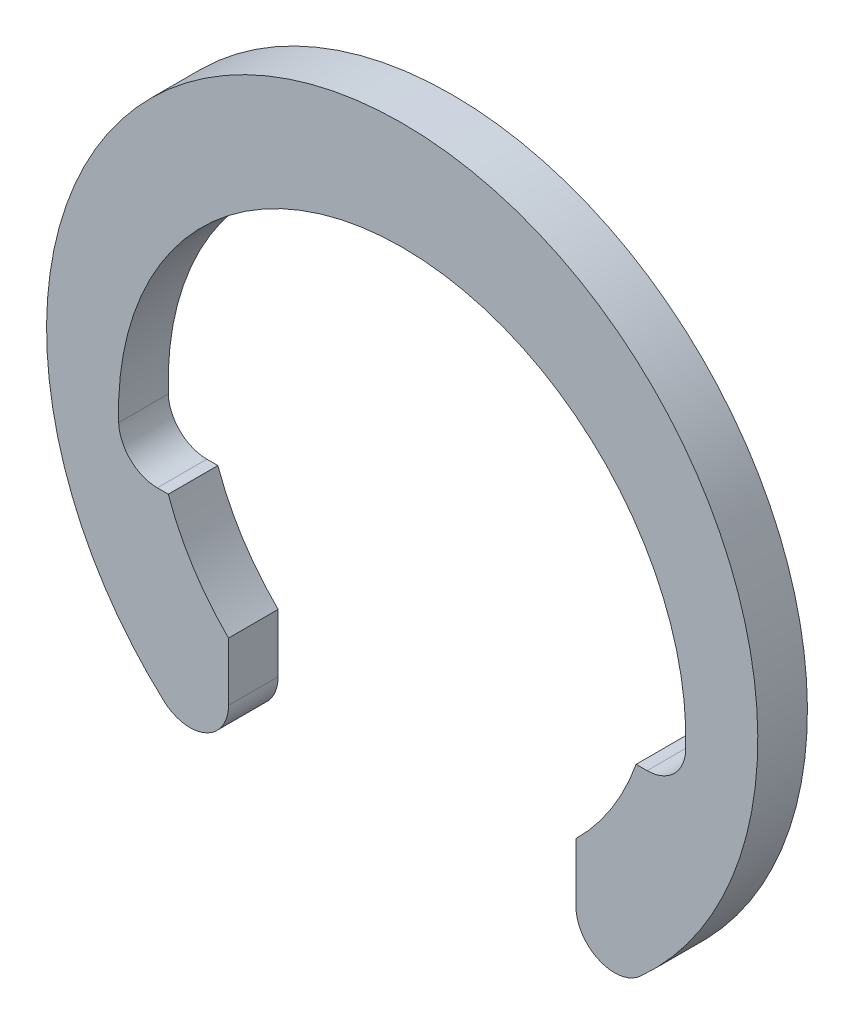
ISO-10303-21;
HEADER;
FILE_DESCRIPTION(('STEP AP214'),'2;1');
FILE_NAME('part.step','',(''),(''),'','','');
FILE_SCHEMA(('AUTOMOTIVE_DESIGN { 1 0 10303 214 1 1 1 1 }'));
ENDSEC;
DATA;
#1=APPLICATION_CONTEXT('core data for automotive mechanical design processes');
#2=APPLICATION_PROTOCOL_DEFINITION('international standard','automotive_design',2000,#1);
#3=PRODUCT_CONTEXT('',#1,'mechanical');
#4=PRODUCT('Part','Part','',(#3));
#5=PRODUCT_RELATED_PRODUCT_CATEGORY('part','',(#4));
#6=PRODUCT_DEFINITION_FORMATION('','',#4);
#7=PRODUCT_DEFINITION_CONTEXT('part definition',#1,'design');
#8=PRODUCT_DEFINITION('design','',#6,#7);
#9=PRODUCT_DEFINITION_SHAPE('','',#8);
#10=(LENGTH_UNIT() NAMED_UNIT(*) SI_UNIT(.MILLI.,.METRE.));
#11=(NAMED_UNIT(*) PLANE_ANGLE_UNIT() SI_UNIT($,.RADIAN.));
#12=(NAMED_UNIT(*) SI_UNIT($,.STERADIAN.) SOLID_ANGLE_UNIT());
#13=UNCERTAINTY_MEASURE_WITH_UNIT(LENGTH_MEASURE(1.E-05),#10,'distance_accuracy_value','');
#14=(GEOMETRIC_REPRESENTATION_CONTEXT(3) GLOBAL_UNCERTAINTY_ASSIGNED_CONTEXT((#13)) GLOBAL_UNIT_ASSIGNED_CONTEXT((#10,
#11,#12)) REPRESENTATION_CONTEXT('',''));
#15=CARTESIAN_POINT('',(0.,0.,0.));
#16=DIRECTION('',(0.,0.,1.));
#17=DIRECTION('',(1.,0.,0.));
#18=AXIS2_PLACEMENT_3D('',#15,#16,#17);
#19=CARTESIAN_POINT('',(0.,0.204126496761375,-0.6));
#20=DIRECTION('',(0.,0.,1.));
#21=DIRECTION('',(1.,0.,0.));
#22=AXIS2_PLACEMENT_3D('',#19,#20,#21);
#23=PLANE('',#22);
#24=CARTESIAN_POINT('',(-2.56666666666667,-2.84722086720835,-0.6));
#25=DIRECTION('',(0.,0.,1.));
#26=DIRECTION('',(0.406469422348528,-0.913664385152258,0.));
#27=AXIS2_PLACEMENT_3D('',#24,#25,#26);
#28=CIRCLE('',#27,0.466666666666667);
#29=CARTESIAN_POINT('',(-2.87913043478261,-3.19383905973806,-0.6));
#30=VERTEX_POINT('',#29);
#31=CARTESIAN_POINT('',(-2.1,-2.84722086720835,-0.6));
#32=VERTEX_POINT('',#31);
#33=EDGE_CURVE('E375',#30,#32,#28,.T.);
#34=ORIENTED_EDGE('',*,*,#33,.F.);
#35=CARTESIAN_POINT('',(0.,0.,-0.6));
#36=DIRECTION('',(0.,0.,1.));
#37=DIRECTION('',(-0.488372093023256,0.872635490199708,0.));
#38=AXIS2_PLACEMENT_3D('',#35,#36,#37);
#39=CIRCLE('',#38,4.3);
#40=CARTESIAN_POINT('',(2.87913043478261,-3.19383905973806,-0.6));
#41=VERTEX_POINT('',#40);
#42=EDGE_CURVE('E154',#41,#30,#39,.T.);
#43=ORIENTED_EDGE('',*,*,#42,.F.);
#44=CARTESIAN_POINT('',(2.56666666666667,-2.84722086720835,-0.6));
#45=DIRECTION('',(0.,0.,1.));
#46=DIRECTION('',(-0.40646942234853,-0.913664385152257,0.));
#47=AXIS2_PLACEMENT_3D('',#44,#45,#46);
#48=CIRCLE('',#47,0.466666666666667);
#49=CARTESIAN_POINT('',(2.1,-2.84722086720835,-0.6));
#50=VERTEX_POINT('',#49);
#51=EDGE_CURVE('E145',#50,#41,#48,.T.);
#52=ORIENTED_EDGE('',*,*,#51,.F.);
#53=DIRECTION('',(0.,-1.,0.));
#54=VECTOR('',#53,1.);
#55=CARTESIAN_POINT('',(2.1,-2.14242852856286,-0.6));
#56=LINE('',#55,#54);
#57=CARTESIAN_POINT('',(2.1,-2.14242852856286,-0.6));
#58=VERTEX_POINT('',#57);
#59=EDGE_CURVE('E193',#58,#50,#56,.T.);
#60=ORIENTED_EDGE('',*,*,#59,.F.);
#61=CARTESIAN_POINT('',(0.,0.,-0.6));
#62=DIRECTION('',(0.,0.,-1.));
#63=DIRECTION('',(0.7,-0.714142842854285,0.));
#64=AXIS2_PLACEMENT_3D('',#61,#62,#63);
#65=CIRCLE('',#64,3.);
#66=CARTESIAN_POINT('',(2.82842712474619,-1.,-0.6));
#67=VERTEX_POINT('',#66);
#68=EDGE_CURVE('E235',#67,#58,#65,.T.);
#69=ORIENTED_EDGE('',*,*,#68,.F.);
#70=DIRECTION('',(-1.,0.,0.));
#71=VECTOR('',#70,1.);
#72=CARTESIAN_POINT('',(2.96153113552207,-1.,-0.6));
#73=LINE('',#72,#71);
#74=CARTESIAN_POINT('',(2.96153113552207,-1.,-0.6));
#75=VERTEX_POINT('',#74);
#76=EDGE_CURVE('E244',#75,#67,#73,.T.);
#77=ORIENTED_EDGE('',*,*,#76,.F.);
#78=CARTESIAN_POINT('',(2.96153113552207,-0.533333333333333,-0.6));
#79=DIRECTION('',(0.,0.,-1.));
#80=DIRECTION('',(0.694668755174056,-0.719329771791024,0.));
#81=AXIS2_PLACEMENT_3D('',#78,#79,#80);
#82=CIRCLE('',#81,0.466666666666667);
#83=CARTESIAN_POINT('',(3.4279139915098,-0.549606299212598,-0.6));
#84=VERTEX_POINT('',#83);
#85=EDGE_CURVE('E239',#84,#75,#82,.T.);
#86=ORIENTED_EDGE('',*,*,#85,.F.);
#87=CARTESIAN_POINT('',(0.,-0.43,-0.6));
#88=DIRECTION('',(0.,0.,-1.));
#89=DIRECTION('',(0.986095307596954,-0.166180758017493,0.));
#90=AXIS2_PLACEMENT_3D('',#87,#88,#89);
#91=CIRCLE('',#90,3.43);
#92=CARTESIAN_POINT('',(-3.4279139915098,-0.549606299212598,-0.6));
#93=VERTEX_POINT('',#92);
#94=EDGE_CURVE('E246',#93,#84,#91,.T.);
#95=ORIENTED_EDGE('',*,*,#94,.F.);
#96=CARTESIAN_POINT('',(-2.96153113552207,-0.533333333333333,-0.6));
#97=DIRECTION('',(0.,0.,-1.));
#98=DIRECTION('',(-0.694668755174057,-0.719329771791024,0.));
#99=AXIS2_PLACEMENT_3D('',#96,#97,#98);
#100=CIRCLE('',#99,0.466666666666667);
#101=CARTESIAN_POINT('',(-2.96153113552207,-1.,-0.6));
#102=VERTEX_POINT('',#101);
#103=EDGE_CURVE('E199',#102,#93,#100,.T.);
#104=ORIENTED_EDGE('',*,*,#103,.F.);
#105=DIRECTION('',(-1.,0.,0.));
#106=VECTOR('',#105,1.);
#107=CARTESIAN_POINT('',(-2.82842712474619,-1.,-0.6));
#108=LINE('',#107,#106);
#109=CARTESIAN_POINT('',(-2.82842712474619,-1.,-0.6));
#110=VERTEX_POINT('',#109);
#111=EDGE_CURVE('E198',#110,#102,#108,.T.);
#112=ORIENTED_EDGE('',*,*,#111,.F.);
#113=CARTESIAN_POINT('',(0.,0.,-0.6));
#114=DIRECTION('',(0.,0.,-1.));
#115=DIRECTION('',(-0.942809041582063,-0.333333333333333,0.));
#116=AXIS2_PLACEMENT_3D('',#113,#114,#115);
#117=CIRCLE('',#116,3.);
#118=CARTESIAN_POINT('',(-2.1,-2.14242852856286,-0.6));
#119=VERTEX_POINT('',#118);
#120=EDGE_CURVE('E11',#119,#110,#117,.T.);
#121=ORIENTED_EDGE('',*,*,#120,.F.);
#122=DIRECTION('',(0.,1.,0.));
#123=VECTOR('',#122,1.);
#124=CARTESIAN_POINT('',(-2.1,-2.84722086720835,-0.6));
#125=LINE('',#124,#123);
#126=EDGE_CURVE('E182',#32,#119,#125,.T.);
#127=ORIENTED_EDGE('',*,*,#126,.F.);
#128=EDGE_LOOP('',(#34,#43,#52,#60,#69,#77,#86,#95,#104,#112,#121,#127));
#129=FACE_BOUND('',#128,.T.);
#130=ADVANCED_FACE('F16',(#129),#23,.F.);
#131=CARTESIAN_POINT('',(0.,0.,0.));
#132=DIRECTION('',(0.,0.,-1.));
#133=DIRECTION('',(-0.942809041582063,-0.333333333333333,0.));
#134=AXIS2_PLACEMENT_3D('',#131,#132,#133);
#135=CYLINDRICAL_SURFACE('',#134,3.);
#136=ORIENTED_EDGE('',*,*,#120,.T.);
#137=DIRECTION('',(0.,0.,-1.));
#138=VECTOR('',#137,1.);
#139=CARTESIAN_POINT('',(-2.82842712474619,-1.,0.));
#140=LINE('',#139,#138);
#141=CARTESIAN_POINT('',(-2.82842712474619,-1.,0.));
#142=VERTEX_POINT('',#141);
#143=EDGE_CURVE('E72',#142,#110,#140,.T.);
#144=ORIENTED_EDGE('',*,*,#143,.F.);
#145=CARTESIAN_POINT('',(0.,0.,0.));
#146=DIRECTION('',(0.,0.,1.));
#147=DIRECTION('',(-0.942809041582063,-0.333333333333333,0.));
#148=AXIS2_PLACEMENT_3D('',#145,#146,#147);
#149=CIRCLE('',#148,3.);
#150=CARTESIAN_POINT('',(-2.1,-2.14242852856286,0.));
#151=VERTEX_POINT('',#150);
#152=EDGE_CURVE('E202',#142,#151,#149,.T.);
#153=ORIENTED_EDGE('',*,*,#152,.T.);
#154=DIRECTION('',(0.,0.,-1.));
#155=VECTOR('',#154,1.);
#156=CARTESIAN_POINT('',(-2.1,-2.14242852856286,0.));
#157=LINE('',#156,#155);
#158=EDGE_CURVE('E27',#151,#119,#157,.T.);
#159=ORIENTED_EDGE('',*,*,#158,.T.);
#160=EDGE_LOOP('',(#136,#144,#153,#159));
#161=FACE_BOUND('',#160,.T.);
#162=ADVANCED_FACE('F293',(#161),#135,.F.);
#163=CARTESIAN_POINT('',(-2.1,-3.75233260785874,0.));
#164=DIRECTION('',(1.,0.,0.));
#165=DIRECTION('',(0.,1.,0.));
#166=AXIS2_PLACEMENT_3D('',#163,#164,#165);
#167=PLANE('',#166);
#168=DIRECTION('',(0.,0.,1.));
#169=VECTOR('',#168,1.);
#170=CARTESIAN_POINT('',(-2.1,-2.84722086720835,-0.6));
#171=LINE('',#170,#169);
#172=CARTESIAN_POINT('',(-2.1,-2.84722086720835,0.));
#173=VERTEX_POINT('',#172);
#174=EDGE_CURVE('E170',#32,#173,#171,.T.);
#175=ORIENTED_EDGE('',*,*,#174,.F.);
#176=ORIENTED_EDGE('',*,*,#126,.T.);
#177=ORIENTED_EDGE('',*,*,#158,.F.);
#178=DIRECTION('',(0.,-1.,0.));
#179=VECTOR('',#178,1.);
#180=CARTESIAN_POINT('',(-2.1,-2.14242852856286,0.));
#181=LINE('',#180,#179);
#182=EDGE_CURVE('E200',#151,#173,#181,.T.);
#183=ORIENTED_EDGE('',*,*,#182,.T.);
#184=EDGE_LOOP('',(#175,#176,#177,#183));
#185=FACE_BOUND('',#184,.T.);
#186=ADVANCED_FACE('F298',(#185),#167,.T.);
#187=CARTESIAN_POINT('',(2.1,-2.14242852856286,0.));
#188=DIRECTION('',(-1.,0.,0.));
#189=DIRECTION('',(0.,0.,1.));
#190=AXIS2_PLACEMENT_3D('',#187,#188,#189);
#191=PLANE('',#190);
#192=DIRECTION('',(0.,0.,-1.));
#193=VECTOR('',#192,1.);
#194=CARTESIAN_POINT('',(2.1,-2.84722086720835,0.));
#195=LINE('',#194,#193);
#196=CARTESIAN_POINT('',(2.1,-2.84722086720835,0.));
#197=VERTEX_POINT('',#196);
#198=EDGE_CURVE('E189',#197,#50,#195,.T.);
#199=ORIENTED_EDGE('',*,*,#198,.F.);
#200=DIRECTION('',(0.,1.,0.));
#201=VECTOR('',#200,1.);
#202=CARTESIAN_POINT('',(2.1,-2.84722086720835,0.));
#203=LINE('',#202,#201);
#204=CARTESIAN_POINT('',(2.1,-2.14242852856286,0.));
#205=VERTEX_POINT('',#204);
#206=EDGE_CURVE('E141',#197,#205,#203,.T.);
#207=ORIENTED_EDGE('',*,*,#206,.T.);
#208=DIRECTION('',(0.,0.,-1.));
#209=VECTOR('',#208,1.);
#210=CARTESIAN_POINT('',(2.1,-2.14242852856286,0.));
#211=LINE('',#210,#209);
#212=EDGE_CURVE('E196',#205,#58,#211,.T.);
#213=ORIENTED_EDGE('',*,*,#212,.T.);
#214=ORIENTED_EDGE('',*,*,#59,.T.);
#215=EDGE_LOOP('',(#199,#207,#213,#214));
#216=FACE_BOUND('',#215,.T.);
#217=ADVANCED_FACE('F304',(#216),#191,.T.);
#218=CARTESIAN_POINT('',(0.,0.,0.));
#219=DIRECTION('',(0.,0.,-1.));
#220=DIRECTION('',(0.7,-0.714142842854285,0.));
#221=AXIS2_PLACEMENT_3D('',#218,#219,#220);
#222=CYLINDRICAL_SURFACE('',#221,3.);
#223=ORIENTED_EDGE('',*,*,#68,.T.);
#224=ORIENTED_EDGE('',*,*,#212,.F.);
#225=CARTESIAN_POINT('',(0.,0.,0.));
#226=DIRECTION('',(0.,0.,1.));
#227=DIRECTION('',(0.7,-0.714142842854285,0.));
#228=AXIS2_PLACEMENT_3D('',#225,#226,#227);
#229=CIRCLE('',#228,3.);
#230=CARTESIAN_POINT('',(2.82842712474619,-1.,0.));
#231=VERTEX_POINT('',#230);
#232=EDGE_CURVE('E176',#205,#231,#229,.T.);
#233=ORIENTED_EDGE('',*,*,#232,.T.);
#234=DIRECTION('',(0.,0.,-1.));
#235=VECTOR('',#234,1.);
#236=CARTESIAN_POINT('',(2.82842712474619,-1.,0.));
#237=LINE('',#236,#235);
#238=EDGE_CURVE('E20',#231,#67,#237,.T.);
#239=ORIENTED_EDGE('',*,*,#238,.T.);
#240=EDGE_LOOP('',(#223,#224,#233,#239));
#241=FACE_BOUND('',#240,.T.);
#242=ADVANCED_FACE('F307',(#241),#222,.F.);
#243=CARTESIAN_POINT('',(3.38230690505756,-1.,0.));
#244=DIRECTION('',(0.,1.,0.));
#245=DIRECTION('',(1.,0.,0.));
#246=AXIS2_PLACEMENT_3D('',#243,#244,#245);
#247=PLANE('',#246);
#248=DIRECTION('',(0.,0.,1.));
#249=VECTOR('',#248,1.);
#250=CARTESIAN_POINT('',(2.96153113552207,-1.,-0.6));
#251=LINE('',#250,#249);
#252=CARTESIAN_POINT('',(2.96153113552207,-1.,0.));
#253=VERTEX_POINT('',#252);
#254=EDGE_CURVE('E258',#75,#253,#251,.T.);
#255=ORIENTED_EDGE('',*,*,#254,.F.);
#256=ORIENTED_EDGE('',*,*,#76,.T.);
#257=ORIENTED_EDGE('',*,*,#238,.F.);
#258=DIRECTION('',(1.,0.,0.));
#259=VECTOR('',#258,1.);
#260=CARTESIAN_POINT('',(2.82842712474619,-1.,0.));
#261=LINE('',#260,#259);
#262=EDGE_CURVE('E172',#231,#253,#261,.T.);
#263=ORIENTED_EDGE('',*,*,#262,.T.);
#264=EDGE_LOOP('',(#255,#256,#257,#263));
#265=FACE_BOUND('',#264,.T.);
#266=ADVANCED_FACE('F18',(#265),#247,.T.);
#267=CARTESIAN_POINT('',(-2.82842712474619,-1.,0.));
#268=DIRECTION('',(0.,1.,0.));
#269=DIRECTION('',(1.,0.,0.));
#270=AXIS2_PLACEMENT_3D('',#267,#268,#269);
#271=PLANE('',#270);
#272=DIRECTION('',(0.,0.,-1.));
#273=VECTOR('',#272,1.);
#274=CARTESIAN_POINT('',(-2.96153113552207,-1.,0.));
#275=LINE('',#274,#273);
#276=CARTESIAN_POINT('',(-2.96153113552207,-1.,0.));
#277=VERTEX_POINT('',#276);
#278=EDGE_CURVE('E249',#277,#102,#275,.T.);
#279=ORIENTED_EDGE('',*,*,#278,.F.);
#280=DIRECTION('',(1.,0.,0.));
#281=VECTOR('',#280,1.);
#282=CARTESIAN_POINT('',(-2.96153113552207,-1.,0.));
#283=LINE('',#282,#281);
#284=EDGE_CURVE('E188',#277,#142,#283,.T.);
#285=ORIENTED_EDGE('',*,*,#284,.T.);
#286=ORIENTED_EDGE('',*,*,#143,.T.);
#287=ORIENTED_EDGE('',*,*,#111,.T.);
#288=EDGE_LOOP('',(#279,#285,#286,#287));
#289=FACE_BOUND('',#288,.T.);
#290=ADVANCED_FACE('F288',(#289),#271,.T.);
#291=CARTESIAN_POINT('',(-2.96153113552207,-0.533333333333333,0.));
#292=DIRECTION('',(0.,0.,-1.));
#293=DIRECTION('',(-0.694668755174057,-0.719329771791024,0.));
#294=AXIS2_PLACEMENT_3D('',#291,#292,#293);
#295=CYLINDRICAL_SURFACE('',#294,0.466666666666667);
#296=CARTESIAN_POINT('',(-2.96153113552207,-0.533333333333333,0.));
#297=DIRECTION('',(0.,0.,1.));
#298=DIRECTION('',(-0.694668755174057,-0.719329771791024,0.));
#299=AXIS2_PLACEMENT_3D('',#296,#297,#298);
#300=CIRCLE('',#299,0.466666666666667);
#301=CARTESIAN_POINT('',(-3.4279139915098,-0.549606299212598,0.));
#302=VERTEX_POINT('',#301);
#303=EDGE_CURVE('E183',#302,#277,#300,.T.);
#304=ORIENTED_EDGE('',*,*,#303,.T.);
#305=ORIENTED_EDGE('',*,*,#278,.T.);
#306=ORIENTED_EDGE('',*,*,#103,.T.);
#307=DIRECTION('',(0.,0.,1.));
#308=VECTOR('',#307,1.);
#309=CARTESIAN_POINT('',(-3.4279139915098,-0.549606299212598,-0.6));
#310=LINE('',#309,#308);
#311=EDGE_CURVE('E250',#93,#302,#310,.T.);
#312=ORIENTED_EDGE('',*,*,#311,.T.);
#313=EDGE_LOOP('',(#304,#305,#306,#312));
#314=FACE_BOUND('',#313,.T.);
#315=ADVANCED_FACE('F275',(#314),#295,.F.);
#316=CARTESIAN_POINT('',(0.,-0.43,0.));
#317=DIRECTION('',(0.,0.,-1.));
#318=DIRECTION('',(0.986095307596954,-0.166180758017493,0.));
#319=AXIS2_PLACEMENT_3D('',#316,#317,#318);
#320=CYLINDRICAL_SURFACE('',#319,3.43);
#321=DIRECTION('',(0.,0.,-1.));
#322=VECTOR('',#321,1.);
#323=CARTESIAN_POINT('',(3.4279139915098,-0.549606299212598,0.));
#324=LINE('',#323,#322);
#325=CARTESIAN_POINT('',(3.4279139915098,-0.549606299212598,0.));
#326=VERTEX_POINT('',#325);
#327=EDGE_CURVE('E192',#326,#84,#324,.T.);
#328=ORIENTED_EDGE('',*,*,#327,.F.);
#329=CARTESIAN_POINT('',(0.,-0.43,0.));
#330=DIRECTION('',(0.,0.,1.));
#331=DIRECTION('',(0.986095307596954,-0.166180758017493,0.));
#332=AXIS2_PLACEMENT_3D('',#329,#330,#331);
#333=CIRCLE('',#332,3.43);
#334=EDGE_CURVE('E187',#326,#302,#333,.T.);
#335=ORIENTED_EDGE('',*,*,#334,.T.);
#336=ORIENTED_EDGE('',*,*,#311,.F.);
#337=ORIENTED_EDGE('',*,*,#94,.T.);
#338=EDGE_LOOP('',(#328,#335,#336,#337));
#339=FACE_BOUND('',#338,.T.);
#340=ADVANCED_FACE('F278',(#339),#320,.F.);
#341=CARTESIAN_POINT('',(2.96153113552207,-0.533333333333333,0.));
#342=DIRECTION('',(0.,0.,-1.));
#343=DIRECTION('',(0.694668755174056,-0.719329771791024,0.));
#344=AXIS2_PLACEMENT_3D('',#341,#342,#343);
#345=CYLINDRICAL_SURFACE('',#344,0.466666666666667);
#346=CARTESIAN_POINT('',(2.96153113552207,-0.533333333333333,0.));
#347=DIRECTION('',(0.,0.,1.));
#348=DIRECTION('',(0.694668755174056,-0.719329771791024,0.));
#349=AXIS2_PLACEMENT_3D('',#346,#347,#348);
#350=CIRCLE('',#349,0.466666666666667);
#351=EDGE_CURVE('E177',#253,#326,#350,.T.);
#352=ORIENTED_EDGE('',*,*,#351,.T.);
#353=ORIENTED_EDGE('',*,*,#327,.T.);
#354=ORIENTED_EDGE('',*,*,#85,.T.);
#355=ORIENTED_EDGE('',*,*,#254,.T.);
#356=EDGE_LOOP('',(#352,#353,#354,#355));
#357=FACE_BOUND('',#356,.T.);
#358=ADVANCED_FACE('F280',(#357),#345,.F.);
#359=CARTESIAN_POINT('',(2.56666666666667,-2.84722086720835,0.));
#360=DIRECTION('',(0.,0.,-1.));
#361=DIRECTION('',(-0.40646942234853,-0.913664385152257,0.));
#362=AXIS2_PLACEMENT_3D('',#359,#360,#361);
#363=CYLINDRICAL_SURFACE('',#362,0.466666666666667);
#364=ORIENTED_EDGE('',*,*,#51,.T.);
#365=DIRECTION('',(0.,0.,1.));
#366=VECTOR('',#365,1.);
#367=CARTESIAN_POINT('',(2.87913043478261,-3.19383905973806,-0.6));
#368=LINE('',#367,#366);
#369=CARTESIAN_POINT('',(2.87913043478261,-3.19383905973806,0.));
#370=VERTEX_POINT('',#369);
#371=EDGE_CURVE('E148',#41,#370,#368,.T.);
#372=ORIENTED_EDGE('',*,*,#371,.T.);
#373=CARTESIAN_POINT('',(2.56666666666667,-2.84722086720835,0.));
#374=DIRECTION('',(0.,0.,-1.));
#375=DIRECTION('',(-0.40646942234853,-0.913664385152257,0.));
#376=AXIS2_PLACEMENT_3D('',#373,#374,#375);
#377=CIRCLE('',#376,0.466666666666667);
#378=EDGE_CURVE('E132',#370,#197,#377,.T.);
#379=ORIENTED_EDGE('',*,*,#378,.T.);
#380=ORIENTED_EDGE('',*,*,#198,.T.);
#381=EDGE_LOOP('',(#364,#372,#379,#380));
#382=FACE_BOUND('',#381,.T.);
#383=ADVANCED_FACE('F149',(#382),#363,.T.);
#384=CARTESIAN_POINT('',(0.,0.204126496761375,0.));
#385=DIRECTION('',(0.,0.,1.));
#386=DIRECTION('',(1.,0.,0.));
#387=AXIS2_PLACEMENT_3D('',#384,#385,#386);
#388=PLANE('',#387);
#389=CARTESIAN_POINT('',(-2.56666666666667,-2.84722086720835,0.));
#390=DIRECTION('',(0.,0.,-1.));
#391=DIRECTION('',(0.406469422348528,-0.913664385152258,0.));
#392=AXIS2_PLACEMENT_3D('',#389,#390,#391);
#393=CIRCLE('',#392,0.466666666666667);
#394=CARTESIAN_POINT('',(-2.87913043478261,-3.19383905973806,0.));
#395=VERTEX_POINT('',#394);
#396=EDGE_CURVE('E166',#173,#395,#393,.T.);
#397=ORIENTED_EDGE('',*,*,#396,.F.);
#398=ORIENTED_EDGE('',*,*,#182,.F.);
#399=ORIENTED_EDGE('',*,*,#152,.F.);
#400=ORIENTED_EDGE('',*,*,#284,.F.);
#401=ORIENTED_EDGE('',*,*,#303,.F.);
#402=ORIENTED_EDGE('',*,*,#334,.F.);
#403=ORIENTED_EDGE('',*,*,#351,.F.);
#404=ORIENTED_EDGE('',*,*,#262,.F.);
#405=ORIENTED_EDGE('',*,*,#232,.F.);
#406=ORIENTED_EDGE('',*,*,#206,.F.);
#407=ORIENTED_EDGE('',*,*,#378,.F.);
#408=CARTESIAN_POINT('',(0.,0.,0.));
#409=DIRECTION('',(0.,0.,-1.));
#410=DIRECTION('',(-0.488372093023256,0.872635490199708,0.));
#411=AXIS2_PLACEMENT_3D('',#408,#409,#410);
#412=CIRCLE('',#411,4.3);
#413=EDGE_CURVE('E137',#395,#370,#412,.T.);
#414=ORIENTED_EDGE('',*,*,#413,.F.);
#415=EDGE_LOOP('',(#397,#398,#399,#400,#401,#402,#403,#404,#405,#406,#407,#414));
#416=FACE_BOUND('',#415,.T.);
#417=ADVANCED_FACE('F135',(#416),#388,.T.);
#418=CARTESIAN_POINT('',(0.,0.,0.));
#419=DIRECTION('',(0.,0.,-1.));
#420=DIRECTION('',(-0.488372093023256,0.872635490199708,0.));
#421=AXIS2_PLACEMENT_3D('',#418,#419,#420);
#422=CYLINDRICAL_SURFACE('',#421,4.3);
#423=DIRECTION('',(0.,0.,-1.));
#424=VECTOR('',#423,1.);
#425=CARTESIAN_POINT('',(-2.87913043478261,-3.19383905973807,0.));
#426=LINE('',#425,#424);
#427=EDGE_CURVE('E158',#395,#30,#426,.T.);
#428=ORIENTED_EDGE('',*,*,#427,.F.);
#429=ORIENTED_EDGE('',*,*,#413,.T.);
#430=ORIENTED_EDGE('',*,*,#371,.F.);
#431=ORIENTED_EDGE('',*,*,#42,.T.);
#432=EDGE_LOOP('',(#428,#429,#430,#431));
#433=FACE_BOUND('',#432,.T.);
#434=ADVANCED_FACE('F156',(#433),#422,.T.);
#435=CARTESIAN_POINT('',(-2.56666666666667,-2.84722086720835,0.));
#436=DIRECTION('',(0.,0.,-1.));
#437=DIRECTION('',(0.406469422348528,-0.913664385152258,0.));
#438=AXIS2_PLACEMENT_3D('',#435,#436,#437);
#439=CYLINDRICAL_SURFACE('',#438,0.466666666666667);
#440=ORIENTED_EDGE('',*,*,#33,.T.);
#441=ORIENTED_EDGE('',*,*,#174,.T.);
#442=ORIENTED_EDGE('',*,*,#396,.T.);
#443=ORIENTED_EDGE('',*,*,#427,.T.);
#444=EDGE_LOOP('',(#440,#441,#442,#443));
#445=FACE_BOUND('',#444,.T.);
#446=ADVANCED_FACE('F300',(#445),#439,.T.);
#447=CLOSED_SHELL('',(#130,#162,#186,#217,#242,#266,#290,#315,#340,#358,#383,#417,#434,#446));
#448=MANIFOLD_SOLID_BREP('B1',#447);
#449=ADVANCED_BREP_SHAPE_REPRESENTATION('',(#18,#448),#14);
#450=SHAPE_DEFINITION_REPRESENTATION(#9,#449);
ENDSEC;
END-ISO-10303-21;
